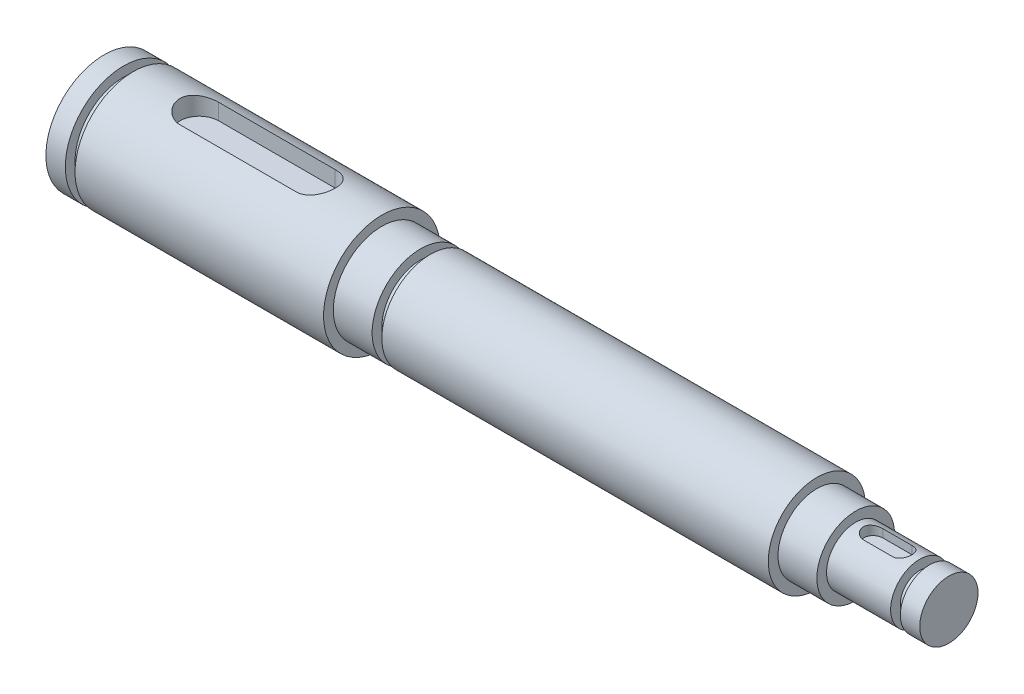
ISO-10303-21;
HEADER;
FILE_DESCRIPTION(('STEP AP214'),'2;1');
FILE_NAME('part.step','',(''),(''),'','','');
FILE_SCHEMA(('AUTOMOTIVE_DESIGN { 1 0 10303 214 1 1 1 1 }'));
ENDSEC;
DATA;
#1=APPLICATION_CONTEXT('core data for automotive mechanical design processes');
#2=APPLICATION_PROTOCOL_DEFINITION('international standard','automotive_design',2000,#1);
#3=PRODUCT_CONTEXT('',#1,'mechanical');
#4=PRODUCT('Part','Part','',(#3));
#5=PRODUCT_RELATED_PRODUCT_CATEGORY('part','',(#4));
#6=PRODUCT_DEFINITION_FORMATION('','',#4);
#7=PRODUCT_DEFINITION_CONTEXT('part definition',#1,'design');
#8=PRODUCT_DEFINITION('design','',#6,#7);
#9=PRODUCT_DEFINITION_SHAPE('','',#8);
#10=(LENGTH_UNIT() NAMED_UNIT(*) SI_UNIT(.MILLI.,.METRE.));
#11=(NAMED_UNIT(*) PLANE_ANGLE_UNIT() SI_UNIT($,.RADIAN.));
#12=(NAMED_UNIT(*) SI_UNIT($,.STERADIAN.) SOLID_ANGLE_UNIT());
#13=UNCERTAINTY_MEASURE_WITH_UNIT(LENGTH_MEASURE(1.E-05),#10,'distance_accuracy_value','');
#14=(GEOMETRIC_REPRESENTATION_CONTEXT(3) GLOBAL_UNCERTAINTY_ASSIGNED_CONTEXT((#13)) GLOBAL_UNIT_ASSIGNED_CONTEXT((#10,
#11,#12)) REPRESENTATION_CONTEXT('',''));
#15=CARTESIAN_POINT('',(0.,0.,0.));
#16=DIRECTION('',(0.,0.,1.));
#17=DIRECTION('',(1.,0.,0.));
#18=AXIS2_PLACEMENT_3D('',#15,#16,#17);
#19=CARTESIAN_POINT('',(0.,0.,0.));
#20=DIRECTION('',(-1.,0.,0.));
#21=DIRECTION('',(0.,0.,1.));
#22=AXIS2_PLACEMENT_3D('',#19,#20,#21);
#23=PLANE('',#22);
#24=CARTESIAN_POINT('',(0.,0.,0.));
#25=DIRECTION('',(1.,0.,0.));
#26=DIRECTION('',(0.,0.,-1.));
#27=AXIS2_PLACEMENT_3D('',#24,#25,#26);
#28=CIRCLE('',#27,9.525);
#29=CARTESIAN_POINT('',(0.,0.,-9.525));
#30=VERTEX_POINT('',#29);
#31=EDGE_CURVE('E209',#30,#30,#28,.T.);
#32=ORIENTED_EDGE('',*,*,#31,.F.);
#33=EDGE_LOOP('',(#32));
#34=FACE_BOUND('',#33,.T.);
#35=ADVANCED_FACE('F36',(#34),#23,.T.);
#36=CARTESIAN_POINT('',(0.,0.,0.));
#37=DIRECTION('',(1.,0.,0.));
#38=DIRECTION('',(0.,0.,-1.));
#39=AXIS2_PLACEMENT_3D('',#36,#37,#38);
#40=CYLINDRICAL_SURFACE('',#39,9.525);
#41=ORIENTED_EDGE('',*,*,#31,.T.);
#42=EDGE_LOOP('',(#41));
#43=FACE_BOUND('',#42,.T.);
#44=CARTESIAN_POINT('',(3.175,0.,0.));
#45=DIRECTION('',(1.,0.,0.));
#46=DIRECTION('',(0.,0.,-1.));
#47=AXIS2_PLACEMENT_3D('',#44,#45,#46);
#48=CIRCLE('',#47,9.525);
#49=CARTESIAN_POINT('',(3.175,0.,-9.525));
#50=VERTEX_POINT('',#49);
#51=EDGE_CURVE('E206',#50,#50,#48,.T.);
#52=ORIENTED_EDGE('',*,*,#51,.F.);
#53=EDGE_LOOP('',(#52));
#54=FACE_BOUND('',#53,.T.);
#55=ADVANCED_FACE('F319',(#43,#54),#40,.T.);
#56=CARTESIAN_POINT('',(3.175,9.525,0.));
#57=DIRECTION('',(1.,0.,0.));
#58=DIRECTION('',(0.,0.,-1.));
#59=AXIS2_PLACEMENT_3D('',#56,#57,#58);
#60=PLANE('',#59);
#61=ORIENTED_EDGE('',*,*,#51,.T.);
#62=EDGE_LOOP('',(#61));
#63=FACE_BOUND('',#62,.T.);
#64=CARTESIAN_POINT('',(3.175,0.,0.));
#65=DIRECTION('',(1.,0.,0.));
#66=DIRECTION('',(0.,0.,-1.));
#67=AXIS2_PLACEMENT_3D('',#64,#65,#66);
#68=CIRCLE('',#67,7.9375);
#69=CARTESIAN_POINT('',(3.175,0.,-7.9375));
#70=VERTEX_POINT('',#69);
#71=EDGE_CURVE('E203',#70,#70,#68,.T.);
#72=ORIENTED_EDGE('',*,*,#71,.F.);
#73=EDGE_LOOP('',(#72));
#74=FACE_BOUND('',#73,.T.);
#75=ADVANCED_FACE('F324',(#63,#74),#60,.T.);
#76=CARTESIAN_POINT('',(0.,0.,0.));
#77=DIRECTION('',(1.,0.,0.));
#78=DIRECTION('',(0.,0.,-1.));
#79=AXIS2_PLACEMENT_3D('',#76,#77,#78);
#80=CYLINDRICAL_SURFACE('',#79,7.9375);
#81=ORIENTED_EDGE('',*,*,#71,.T.);
#82=EDGE_LOOP('',(#81));
#83=FACE_BOUND('',#82,.T.);
#84=CARTESIAN_POINT('',(4.7625,0.,0.));
#85=DIRECTION('',(1.,0.,0.));
#86=DIRECTION('',(0.,0.,-1.));
#87=AXIS2_PLACEMENT_3D('',#84,#85,#86);
#88=CIRCLE('',#87,7.9375);
#89=CARTESIAN_POINT('',(4.7625,0.,-7.9375));
#90=VERTEX_POINT('',#89);
#91=EDGE_CURVE('E200',#90,#90,#88,.T.);
#92=ORIENTED_EDGE('',*,*,#91,.F.);
#93=EDGE_LOOP('',(#92));
#94=FACE_BOUND('',#93,.T.);
#95=ADVANCED_FACE('F332',(#83,#94),#80,.T.);
#96=CARTESIAN_POINT('',(4.7625,7.9375,0.));
#97=DIRECTION('',(-1.,0.,0.));
#98=DIRECTION('',(0.,0.,1.));
#99=AXIS2_PLACEMENT_3D('',#96,#97,#98);
#100=PLANE('',#99);
#101=ORIENTED_EDGE('',*,*,#91,.T.);
#102=EDGE_LOOP('',(#101));
#103=FACE_BOUND('',#102,.T.);
#104=CARTESIAN_POINT('',(4.7625,0.,0.));
#105=DIRECTION('',(1.,0.,0.));
#106=DIRECTION('',(0.,0.,-1.));
#107=AXIS2_PLACEMENT_3D('',#104,#105,#106);
#108=CIRCLE('',#107,9.525);
#109=CARTESIAN_POINT('',(4.7625,0.,-9.525));
#110=VERTEX_POINT('',#109);
#111=EDGE_CURVE('E197',#110,#110,#108,.T.);
#112=ORIENTED_EDGE('',*,*,#111,.F.);
#113=EDGE_LOOP('',(#112));
#114=FACE_BOUND('',#113,.T.);
#115=ADVANCED_FACE('F338',(#103,#114),#100,.T.);
#116=CARTESIAN_POINT('',(0.,0.,0.));
#117=DIRECTION('',(1.,0.,0.));
#118=DIRECTION('',(0.,0.,-1.));
#119=AXIS2_PLACEMENT_3D('',#116,#117,#118);
#120=CYLINDRICAL_SURFACE('',#119,9.525);
#121=CARTESIAN_POINT('',(34.6075,8.98025612106915,3.175));
#122=CARTESIAN_POINT('',(34.6941229888318,8.9802423045691,3.17501141870215));
#123=CARTESIAN_POINT('',(34.7807382548377,8.98150913758803,3.17145526771413));
#124=CARTESIAN_POINT('',(34.9532969187036,8.9865012563368,3.15729678141198));
#125=CARTESIAN_POINT('',(35.0392404915948,8.99022587842316,3.14669634816447));
#126=CARTESIAN_POINT('',(35.2095949202103,9.00001635670684,3.1185797346695));
#127=CARTESIAN_POINT('',(35.2940095522396,9.0060752675965,3.10108406659181));
#128=CARTESIAN_POINT('',(35.4609505011002,9.02033527280623,3.05935609908253));
#129=CARTESIAN_POINT('',(35.5434767495693,9.0285364445462,3.03512355618263));
#130=CARTESIAN_POINT('',(35.7872812062373,9.05598824808267,2.95264270158864));
#131=CARTESIAN_POINT('',(35.9450375299855,9.07810279732742,2.88456899348992));
#132=CARTESIAN_POINT('',(36.2469135505599,9.12745233291153,2.72437585814969));
#133=CARTESIAN_POINT('',(36.3910247994461,9.15469046059877,2.63224166551133));
#134=CARTESIAN_POINT('',(36.6671769874024,9.21240451634628,2.42269004725358));
#135=CARTESIAN_POINT('',(36.7986121312949,9.24296080573605,2.30449481480772));
#136=CARTESIAN_POINT('',(37.0402067211275,9.30318975942108,2.04783780412336));
#137=CARTESIAN_POINT('',(37.1503623785527,9.33286226557717,1.90937242476788));
#138=CARTESIAN_POINT('',(37.3490467447338,9.38891576742204,1.61164171565864));
#139=CARTESIAN_POINT('',(37.4369359305322,9.41519063786191,1.45192782105673));
#140=CARTESIAN_POINT('',(37.5843555939925,9.46053507792341,1.11896283130951));
#141=CARTESIAN_POINT('',(37.6438947346775,9.47960684825285,0.945715890365636));
#142=CARTESIAN_POINT('',(37.7308608797652,9.50782550756653,0.596993181200781));
#143=CARTESIAN_POINT('',(37.7593328731396,9.5172945599896,0.421804576215316));
#144=CARTESIAN_POINT('',(37.7866792650331,9.52638456721869,0.0688942262177281));
#145=CARTESIAN_POINT('',(37.7855607159795,9.52600786860052,-0.108826905115811));
#146=CARTESIAN_POINT('',(37.7544193835561,9.51566672631501,-0.454354710768469));
#147=CARTESIAN_POINT('',(37.7255320714269,9.50607893544864,-0.622276840369554));
#148=CARTESIAN_POINT('',(37.6415516472644,9.47886599692519,-0.950734894861877));
#149=CARTESIAN_POINT('',(37.5864570821377,9.46124040360451,-1.11127040965181));
#150=CARTESIAN_POINT('',(37.4509619543152,9.41945246382315,-1.422884614729));
#151=CARTESIAN_POINT('',(37.3702380671974,9.39520718715483,-1.5738111430507));
#152=CARTESIAN_POINT('',(37.186045394075,9.34270382305686,-1.86031043274779));
#153=CARTESIAN_POINT('',(37.082570420982,9.31444464480037,-1.99587900234785));
#154=CARTESIAN_POINT('',(36.8500915243982,9.25532407861077,-2.25455959173543));
#155=CARTESIAN_POINT('',(36.7201163706817,9.22440281116213,-2.37678676918464));
#156=CARTESIAN_POINT('',(36.4412593020655,9.16455803450652,-2.59801162582849));
#157=CARTESIAN_POINT('',(36.2923713029155,9.13563517282882,-2.69700180037897));
#158=CARTESIAN_POINT('',(35.9768985838664,9.08272269199518,-2.87021834678402));
#159=CARTESIAN_POINT('',(35.8100850650662,9.05881220234969,-2.94405757319701));
#160=CARTESIAN_POINT('',(35.5518676242628,9.02936653323678,-3.0326733025657));
#161=CARTESIAN_POINT('',(35.464478265434,9.02062228933348,-3.05851877555986));
#162=CARTESIAN_POINT('',(35.2876163306774,9.00554368630543,-3.10263697775581));
#163=CARTESIAN_POINT('',(35.1981447257693,8.99920822686967,-3.12091316488063));
#164=CARTESIAN_POINT('',(35.0252947810473,8.98959087559101,-3.14850521757429));
#165=CARTESIAN_POINT('',(34.9420255558268,8.9860995295135,-3.15843785822583));
#166=CARTESIAN_POINT('',(34.7750071479407,8.98142776184118,-3.17168561119408));
#167=CARTESIAN_POINT('',(34.6912587249957,8.98024435831545,-3.17500926263186));
#168=CARTESIAN_POINT('',(34.6075,8.98025612106916,-3.175));
#169=B_SPLINE_CURVE_WITH_KNOTS('',3,(#121,#122,#123,#124,#125,#126,#127,#128,#129,#130,#131,
#132,#133,#134,#135,#136,#137,#138,#139,#140,#141,#142,#143,#144,#145,#146,#147,#148,#149,#150,
#151,#152,#153,#154,#155,#156,#157,#158,#159,#160,#161,#162,#163,#164,#165,#166,#167,#168),
.UNSPECIFIED.,.F.,.F.,(4,2,2,2,2,2,2,2,2,2,2,2,2,2,2,2,2,2,2,2,2,2,2,4),(0.,0.259773689035001,
0.519477263588045,0.778414025374931,1.03736014626284,1.55449291492533,2.07194378556213,
2.60766387392255,3.14347925203152,3.69327981198351,4.24291225945333,4.77342553695258,
5.30381237633043,5.81339512764462,6.3230061366944,6.83932018908201,7.35577482555093,
7.89650105770063,8.43740168377098,8.9862872915728,9.26063415404914,9.53485554636031,
9.78636405546802,10.0375473922007),.UNSPECIFIED.);
#170=CARTESIAN_POINT('',(34.6075,8.98025612106915,3.175));
#171=VERTEX_POINT('',#170);
#172=CARTESIAN_POINT('',(34.6075,8.98025612106915,-3.175));
#173=VERTEX_POINT('',#172);
#174=EDGE_CURVE('E212',#171,#173,#169,.T.);
#175=ORIENTED_EDGE('',*,*,#174,.F.);
#176=DIRECTION('',(1.,0.,0.));
#177=VECTOR('',#176,1.);
#178=CARTESIAN_POINT('',(0.,8.98025612106915,3.175));
#179=LINE('',#178,#177);
#180=CARTESIAN_POINT('',(15.5575,8.98025612106915,3.175));
#181=VERTEX_POINT('',#180);
#182=EDGE_CURVE('E251',#181,#171,#179,.T.);
#183=ORIENTED_EDGE('',*,*,#182,.F.);
#184=CARTESIAN_POINT('',(15.5575,8.98025612106915,-3.175));
#185=CARTESIAN_POINT('',(15.4708770111682,8.9802423045691,-3.17501141870215));
#186=CARTESIAN_POINT('',(15.3842617451623,8.98150913758803,-3.17145526771413));
#187=CARTESIAN_POINT('',(15.2117030812964,8.9865012563368,-3.15729678141198));
#188=CARTESIAN_POINT('',(15.1257595084052,8.99022587842316,-3.14669634816447));
#189=CARTESIAN_POINT('',(14.9554050797897,9.00001635670684,-3.1185797346695));
#190=CARTESIAN_POINT('',(14.8709904477604,9.0060752675965,-3.10108406659181));
#191=CARTESIAN_POINT('',(14.7040494988998,9.02033527280623,-3.05935609908253));
#192=CARTESIAN_POINT('',(14.6215232504307,9.0285364445462,-3.03512355618263));
#193=CARTESIAN_POINT('',(14.3777187937627,9.05598824808267,-2.95264270158864));
#194=CARTESIAN_POINT('',(14.2199624700145,9.07810279732742,-2.88456899348992));
#195=CARTESIAN_POINT('',(13.9180864494401,9.12745233291153,-2.72437585814969));
#196=CARTESIAN_POINT('',(13.7739752005539,9.15469046059877,-2.63224166551133));
#197=CARTESIAN_POINT('',(13.4978230125975,9.21240451634628,-2.42269004725358));
#198=CARTESIAN_POINT('',(13.3663878687051,9.24296080573605,-2.30449481480772));
#199=CARTESIAN_POINT('',(13.1247932788725,9.30318975942108,-2.04783780412336));
#200=CARTESIAN_POINT('',(13.0146376214474,9.33286226557717,-1.90937242476788));
#201=CARTESIAN_POINT('',(12.8159532552662,9.38891576742204,-1.61164171565864));
#202=CARTESIAN_POINT('',(12.7280640694678,9.41519063786191,-1.45192782105673));
#203=CARTESIAN_POINT('',(12.5806444060075,9.46053507792341,-1.11896283130951));
#204=CARTESIAN_POINT('',(12.5211052653225,9.47960684825285,-0.94571589036564));
#205=CARTESIAN_POINT('',(12.4341391202348,9.50782550756653,-0.596993181200784));
#206=CARTESIAN_POINT('',(12.4056671268604,9.5172945599896,-0.421804576215318));
#207=CARTESIAN_POINT('',(12.3783207349669,9.52638456721869,-0.0688942262177296));
#208=CARTESIAN_POINT('',(12.3794392840205,9.52600786860052,0.10882690511581));
#209=CARTESIAN_POINT('',(12.4105806164439,9.51566672631501,0.454354710768468));
#210=CARTESIAN_POINT('',(12.4394679285731,9.50607893544864,0.622276840369554));
#211=CARTESIAN_POINT('',(12.5234483527356,9.47886599692519,0.950734894861878));
#212=CARTESIAN_POINT('',(12.5785429178623,9.46124040360451,1.11127040965182));
#213=CARTESIAN_POINT('',(12.7140380456848,9.41945246382315,1.422884614729));
#214=CARTESIAN_POINT('',(12.7947619328026,9.39520718715483,1.5738111430507));
#215=CARTESIAN_POINT('',(12.978954605925,9.34270382305686,1.86031043274779));
#216=CARTESIAN_POINT('',(13.082429579018,9.31444464480037,1.99587900234785));
#217=CARTESIAN_POINT('',(13.3149084756018,9.25532407861076,2.25455959173543));
#218=CARTESIAN_POINT('',(13.4448836293183,9.22440281116213,2.37678676918464));
#219=CARTESIAN_POINT('',(13.7237406979345,9.16455803450652,2.59801162582849));
#220=CARTESIAN_POINT('',(13.8726286970845,9.13563517282882,2.69700180037897));
#221=CARTESIAN_POINT('',(14.1881014161336,9.08272269199518,2.87021834678402));
#222=CARTESIAN_POINT('',(14.3549149349338,9.05881220234969,2.94405757319701));
#223=CARTESIAN_POINT('',(14.6131323757371,9.02936653323678,3.03267330256571));
#224=CARTESIAN_POINT('',(14.700521734566,9.02062228933348,3.05851877555986));
#225=CARTESIAN_POINT('',(14.8773836693226,9.00554368630543,3.10263697775581));
#226=CARTESIAN_POINT('',(14.9668552742307,8.99920822686967,3.12091316488063));
#227=CARTESIAN_POINT('',(15.1397052189527,8.98959087559101,3.14850521757429));
#228=CARTESIAN_POINT('',(15.2229744441732,8.9860995295135,3.15843785822583));
#229=CARTESIAN_POINT('',(15.3899928520593,8.98142776184118,3.17168561119408));
#230=CARTESIAN_POINT('',(15.4737412750042,8.98024435831545,3.17500926263186));
#231=CARTESIAN_POINT('',(15.5575,8.98025612106916,3.175));
#232=B_SPLINE_CURVE_WITH_KNOTS('',3,(#184,#185,#186,#187,#188,#189,#190,#191,#192,#193,#194,
#195,#196,#197,#198,#199,#200,#201,#202,#203,#204,#205,#206,#207,#208,#209,#210,#211,#212,#213,
#214,#215,#216,#217,#218,#219,#220,#221,#222,#223,#224,#225,#226,#227,#228,#229,#230,#231),
.UNSPECIFIED.,.F.,.F.,(4,2,2,2,2,2,2,2,2,2,2,2,2,2,2,2,2,2,2,2,2,2,2,4),(0.,0.259773689035001,
0.519477263588043,0.778414025374926,1.03736014626284,1.55449291492533,2.07194378556214,
2.60766387392255,3.14347925203151,3.6932798119835,4.24291225945333,4.77342553695257,
5.30381237633043,5.81339512764462,6.3230061366944,6.83932018908201,7.35577482555094,
7.89650105770063,8.43740168377098,8.9862872915728,9.26063415404914,9.53485554636031,
9.78636405546803,10.0375473922007),.UNSPECIFIED.);
#233=CARTESIAN_POINT('',(15.5575,8.98025612106915,-3.175));
#234=VERTEX_POINT('',#233);
#235=EDGE_CURVE('E245',#234,#181,#232,.T.);
#236=ORIENTED_EDGE('',*,*,#235,.F.);
#237=DIRECTION('',(1.,0.,0.));
#238=VECTOR('',#237,1.);
#239=CARTESIAN_POINT('',(0.,8.98025612106915,-3.175));
#240=LINE('',#239,#238);
#241=EDGE_CURVE('E220',#173,#234,#240,.F.);
#242=ORIENTED_EDGE('',*,*,#241,.F.);
#243=EDGE_LOOP('',(#175,#183,#236,#242));
#244=FACE_BOUND('',#243,.T.);
#245=ORIENTED_EDGE('',*,*,#111,.T.);
#246=EDGE_LOOP('',(#245));
#247=FACE_BOUND('',#246,.T.);
#248=CARTESIAN_POINT('',(45.4025,0.,0.));
#249=DIRECTION('',(1.,0.,0.));
#250=DIRECTION('',(0.,0.,-1.));
#251=AXIS2_PLACEMENT_3D('',#248,#249,#250);
#252=CIRCLE('',#251,9.525);
#253=CARTESIAN_POINT('',(45.4025,0.,-9.525));
#254=VERTEX_POINT('',#253);
#255=EDGE_CURVE('E194',#254,#254,#252,.T.);
#256=ORIENTED_EDGE('',*,*,#255,.F.);
#257=EDGE_LOOP('',(#256));
#258=FACE_BOUND('',#257,.T.);
#259=ADVANCED_FACE('F222',(#244,#247,#258),#120,.T.);
#260=CARTESIAN_POINT('',(45.4025,9.525,0.));
#261=DIRECTION('',(1.,0.,0.));
#262=DIRECTION('',(0.,0.,-1.));
#263=AXIS2_PLACEMENT_3D('',#260,#261,#262);
#264=PLANE('',#263);
#265=ORIENTED_EDGE('',*,*,#255,.T.);
#266=EDGE_LOOP('',(#265));
#267=FACE_BOUND('',#266,.T.);
#268=CARTESIAN_POINT('',(45.4025,0.,0.));
#269=DIRECTION('',(1.,0.,0.));
#270=DIRECTION('',(0.,0.,-1.));
#271=AXIS2_PLACEMENT_3D('',#268,#269,#270);
#272=CIRCLE('',#271,7.93750000000001);
#273=CARTESIAN_POINT('',(45.4025,0.,-7.93750000000001));
#274=VERTEX_POINT('',#273);
#275=EDGE_CURVE('E191',#274,#274,#272,.T.);
#276=ORIENTED_EDGE('',*,*,#275,.F.);
#277=EDGE_LOOP('',(#276));
#278=FACE_BOUND('',#277,.T.);
#279=ADVANCED_FACE('F348',(#267,#278),#264,.T.);
#280=CARTESIAN_POINT('',(0.,0.,0.));
#281=DIRECTION('',(1.,0.,0.));
#282=DIRECTION('',(0.,0.,-1.));
#283=AXIS2_PLACEMENT_3D('',#280,#281,#282);
#284=CYLINDRICAL_SURFACE('',#283,7.93750000000001);
#285=ORIENTED_EDGE('',*,*,#275,.T.);
#286=EDGE_LOOP('',(#285));
#287=FACE_BOUND('',#286,.T.);
#288=CARTESIAN_POINT('',(51.7525,0.,0.));
#289=DIRECTION('',(1.,0.,0.));
#290=DIRECTION('',(0.,0.,-1.));
#291=AXIS2_PLACEMENT_3D('',#288,#289,#290);
#292=CIRCLE('',#291,7.93750000000001);
#293=CARTESIAN_POINT('',(51.7525,0.,-7.93750000000001));
#294=VERTEX_POINT('',#293);
#295=EDGE_CURVE('E188',#294,#294,#292,.T.);
#296=ORIENTED_EDGE('',*,*,#295,.F.);
#297=EDGE_LOOP('',(#296));
#298=FACE_BOUND('',#297,.T.);
#299=ADVANCED_FACE('F354',(#287,#298),#284,.T.);
#300=CARTESIAN_POINT('',(51.7525,7.93750000000001,0.));
#301=DIRECTION('',(1.,0.,0.));
#302=DIRECTION('',(0.,0.,-1.));
#303=AXIS2_PLACEMENT_3D('',#300,#301,#302);
#304=PLANE('',#303);
#305=ORIENTED_EDGE('',*,*,#295,.T.);
#306=EDGE_LOOP('',(#305));
#307=FACE_BOUND('',#306,.T.);
#308=CARTESIAN_POINT('',(51.7525,0.,0.));
#309=DIRECTION('',(1.,0.,0.));
#310=DIRECTION('',(0.,0.,-1.));
#311=AXIS2_PLACEMENT_3D('',#308,#309,#310);
#312=CIRCLE('',#311,6.35000000000001);
#313=CARTESIAN_POINT('',(51.7525,0.,-6.35000000000001));
#314=VERTEX_POINT('',#313);
#315=EDGE_CURVE('E185',#314,#314,#312,.T.);
#316=ORIENTED_EDGE('',*,*,#315,.F.);
#317=EDGE_LOOP('',(#316));
#318=FACE_BOUND('',#317,.T.);
#319=ADVANCED_FACE('F359',(#307,#318),#304,.T.);
#320=CARTESIAN_POINT('',(0.,0.,0.));
#321=DIRECTION('',(1.,0.,0.));
#322=DIRECTION('',(0.,0.,-1.));
#323=AXIS2_PLACEMENT_3D('',#320,#321,#322);
#324=CYLINDRICAL_SURFACE('',#323,6.35000000000001);
#325=ORIENTED_EDGE('',*,*,#315,.T.);
#326=EDGE_LOOP('',(#325));
#327=FACE_BOUND('',#326,.T.);
#328=CARTESIAN_POINT('',(53.34,0.,0.));
#329=DIRECTION('',(1.,0.,0.));
#330=DIRECTION('',(0.,0.,-1.));
#331=AXIS2_PLACEMENT_3D('',#328,#329,#330);
#332=CIRCLE('',#331,6.35000000000001);
#333=CARTESIAN_POINT('',(53.34,0.,-6.35000000000001));
#334=VERTEX_POINT('',#333);
#335=EDGE_CURVE('E182',#334,#334,#332,.T.);
#336=ORIENTED_EDGE('',*,*,#335,.F.);
#337=EDGE_LOOP('',(#336));
#338=FACE_BOUND('',#337,.T.);
#339=ADVANCED_FACE('F365',(#327,#338),#324,.T.);
#340=CARTESIAN_POINT('',(53.34,6.35000000000001,0.));
#341=DIRECTION('',(-1.,0.,0.));
#342=DIRECTION('',(0.,0.,1.));
#343=AXIS2_PLACEMENT_3D('',#340,#341,#342);
#344=PLANE('',#343);
#345=ORIENTED_EDGE('',*,*,#335,.T.);
#346=EDGE_LOOP('',(#345));
#347=FACE_BOUND('',#346,.T.);
#348=CARTESIAN_POINT('',(53.34,0.,0.));
#349=DIRECTION('',(1.,0.,0.));
#350=DIRECTION('',(0.,0.,-1.));
#351=AXIS2_PLACEMENT_3D('',#348,#349,#350);
#352=CIRCLE('',#351,7.93750000000001);
#353=CARTESIAN_POINT('',(53.34,0.,-7.93750000000001));
#354=VERTEX_POINT('',#353);
#355=EDGE_CURVE('E179',#354,#354,#352,.T.);
#356=ORIENTED_EDGE('',*,*,#355,.F.);
#357=EDGE_LOOP('',(#356));
#358=FACE_BOUND('',#357,.T.);
#359=ADVANCED_FACE('F371',(#347,#358),#344,.T.);
#360=CARTESIAN_POINT('',(0.,0.,0.));
#361=DIRECTION('',(1.,0.,0.));
#362=DIRECTION('',(0.,0.,-1.));
#363=AXIS2_PLACEMENT_3D('',#360,#361,#362);
#364=CYLINDRICAL_SURFACE('',#363,7.93750000000001);
#365=ORIENTED_EDGE('',*,*,#355,.T.);
#366=EDGE_LOOP('',(#365));
#367=FACE_BOUND('',#366,.T.);
#368=CARTESIAN_POINT('',(116.5225,0.,0.));
#369=DIRECTION('',(1.,0.,0.));
#370=DIRECTION('',(0.,0.,-1.));
#371=AXIS2_PLACEMENT_3D('',#368,#369,#370);
#372=CIRCLE('',#371,7.93750000000001);
#373=CARTESIAN_POINT('',(116.5225,0.,-7.93750000000001));
#374=VERTEX_POINT('',#373);
#375=EDGE_CURVE('E176',#374,#374,#372,.T.);
#376=ORIENTED_EDGE('',*,*,#375,.F.);
#377=EDGE_LOOP('',(#376));
#378=FACE_BOUND('',#377,.T.);
#379=ADVANCED_FACE('F377',(#367,#378),#364,.T.);
#380=CARTESIAN_POINT('',(116.5225,7.93750000000001,0.));
#381=DIRECTION('',(1.,0.,0.));
#382=DIRECTION('',(0.,0.,-1.));
#383=AXIS2_PLACEMENT_3D('',#380,#381,#382);
#384=PLANE('',#383);
#385=ORIENTED_EDGE('',*,*,#375,.T.);
#386=EDGE_LOOP('',(#385));
#387=FACE_BOUND('',#386,.T.);
#388=CARTESIAN_POINT('',(116.5225,0.,0.));
#389=DIRECTION('',(1.,0.,0.));
#390=DIRECTION('',(0.,0.,-1.));
#391=AXIS2_PLACEMENT_3D('',#388,#389,#390);
#392=CIRCLE('',#391,6.35000000000001);
#393=CARTESIAN_POINT('',(116.5225,0.,-6.35000000000001));
#394=VERTEX_POINT('',#393);
#395=EDGE_CURVE('E173',#394,#394,#392,.T.);
#396=ORIENTED_EDGE('',*,*,#395,.F.);
#397=EDGE_LOOP('',(#396));
#398=FACE_BOUND('',#397,.T.);
#399=ADVANCED_FACE('F383',(#387,#398),#384,.T.);
#400=CARTESIAN_POINT('',(0.,0.,0.));
#401=DIRECTION('',(1.,0.,0.));
#402=DIRECTION('',(0.,0.,-1.));
#403=AXIS2_PLACEMENT_3D('',#400,#401,#402);
#404=CYLINDRICAL_SURFACE('',#403,6.35000000000001);
#405=ORIENTED_EDGE('',*,*,#395,.T.);
#406=EDGE_LOOP('',(#405));
#407=FACE_BOUND('',#406,.T.);
#408=CARTESIAN_POINT('',(122.8725,0.,0.));
#409=DIRECTION('',(1.,0.,0.));
#410=DIRECTION('',(0.,0.,-1.));
#411=AXIS2_PLACEMENT_3D('',#408,#409,#410);
#412=CIRCLE('',#411,6.35000000000001);
#413=CARTESIAN_POINT('',(122.8725,0.,-6.35000000000001));
#414=VERTEX_POINT('',#413);
#415=EDGE_CURVE('E170',#414,#414,#412,.T.);
#416=ORIENTED_EDGE('',*,*,#415,.F.);
#417=EDGE_LOOP('',(#416));
#418=FACE_BOUND('',#417,.T.);
#419=ADVANCED_FACE('F389',(#407,#418),#404,.T.);
#420=CARTESIAN_POINT('',(122.8725,6.35000000000001,0.));
#421=DIRECTION('',(1.,0.,0.));
#422=DIRECTION('',(0.,0.,-1.));
#423=AXIS2_PLACEMENT_3D('',#420,#421,#422);
#424=PLANE('',#423);
#425=ORIENTED_EDGE('',*,*,#415,.T.);
#426=EDGE_LOOP('',(#425));
#427=FACE_BOUND('',#426,.T.);
#428=CARTESIAN_POINT('',(122.8725,0.,0.));
#429=DIRECTION('',(1.,0.,0.));
#430=DIRECTION('',(0.,0.,-1.));
#431=AXIS2_PLACEMENT_3D('',#428,#429,#430);
#432=CIRCLE('',#431,4.76250000000002);
#433=CARTESIAN_POINT('',(122.8725,0.,-4.76250000000002));
#434=VERTEX_POINT('',#433);
#435=EDGE_CURVE('E167',#434,#434,#432,.T.);
#436=ORIENTED_EDGE('',*,*,#435,.F.);
#437=EDGE_LOOP('',(#436));
#438=FACE_BOUND('',#437,.T.);
#439=ADVANCED_FACE('F289',(#427,#438),#424,.T.);
#440=CARTESIAN_POINT('',(0.,0.,0.));
#441=DIRECTION('',(1.,0.,0.));
#442=DIRECTION('',(0.,0.,-1.));
#443=AXIS2_PLACEMENT_3D('',#440,#441,#442);
#444=CYLINDRICAL_SURFACE('',#443,4.76250000000002);
#445=CARTESIAN_POINT('',(130.4925,4.49012806053459,1.5875));
#446=CARTESIAN_POINT('',(130.535823663672,4.49012376824764,1.58750118659148));
#447=CARTESIAN_POINT('',(130.579125211226,4.49075587659903,1.58572537278249));
#448=CARTESIAN_POINT('',(130.665392377187,4.4932493207164,1.57865065117029));
#449=CARTESIAN_POINT('',(130.70835808311,4.49511032466045,1.57335269440072));
#450=CARTESIAN_POINT('',(130.836022527322,4.50245308906635,1.55227444692888));
#451=CARTESIAN_POINT('',(130.919824593454,4.50969526842982,1.53130921993213));
#452=CARTESIAN_POINT('',(131.082454993004,4.5279956858444,1.4763089787808));
#453=CARTESIAN_POINT('',(131.161286043161,4.53905181775277,1.44228117688021));
#454=CARTESIAN_POINT('',(131.312189486484,4.56372574710895,1.36219125098173));
#455=CARTESIAN_POINT('',(131.384257692394,4.57734511612123,1.31612173723109));
#456=CARTESIAN_POINT('',(131.522343367228,4.60620237638252,1.21134408721778));
#457=CARTESIAN_POINT('',(131.588057372734,4.62148043457192,1.15224715626124));
#458=CARTESIAN_POINT('',(131.708852053244,4.65159484800104,1.02391915324899));
#459=CARTESIAN_POINT('',(131.763930834794,4.66643112419068,0.954686280480328));
#460=CARTESIAN_POINT('',(131.863273736102,4.69445789253337,0.805820787955566));
#461=CARTESIAN_POINT('',(131.907218062739,4.70759532129445,0.725963891856615));
#462=CARTESIAN_POINT('',(131.980927699554,4.73026753659897,0.559481434320802));
#463=CARTESIAN_POINT('',(132.01069734114,4.7398034234938,0.472857950004548));
#464=CARTESIAN_POINT('',(132.05418046517,4.75391275439391,0.298496585946374));
#465=CARTESIAN_POINT('',(132.068416445179,4.75864728019362,0.210902287205421));
#466=CARTESIAN_POINT('',(132.082089623909,4.76319228341061,0.0344471140108763));
#467=CARTESIAN_POINT('',(132.081530348841,4.76300393411569,-0.0544134536020655));
#468=CARTESIAN_POINT('',(132.065959700568,4.75783336333486,-0.227177354381039));
#469=CARTESIAN_POINT('',(132.051516062239,4.75303946823633,-0.311138415418041));
#470=CARTESIAN_POINT('',(132.009525797105,4.73943299795059,-0.475367452197943));
#471=CARTESIAN_POINT('',(131.981978443748,4.7306201999315,-0.555635222891139));
#472=CARTESIAN_POINT('',(131.914231075759,4.70972623380697,-0.711442289061659));
#473=CARTESIAN_POINT('',(131.873869403368,4.69760360068322,-0.78690550272572));
#474=CARTESIAN_POINT('',(131.781772327167,4.67135190442071,-0.930155285192268));
#475=CARTESIAN_POINT('',(131.730033829464,4.65722229586181,-0.997939758172062));
#476=CARTESIAN_POINT('',(131.61379720813,4.62766206709101,-1.12727952679154));
#477=CARTESIAN_POINT('',(131.54881369952,4.61220151154365,-1.18839235843516));
#478=CARTESIAN_POINT('',(131.409374135076,4.58227891125653,-1.29900683940236));
#479=CARTESIAN_POINT('',(131.334915030935,4.5678171901626,-1.3485047375543));
#480=CARTESIAN_POINT('',(131.177220216864,4.54136174809906,-1.43510527937854));
#481=CARTESIAN_POINT('',(131.093871170044,4.52940761230324,-1.47201415259344));
#482=CARTESIAN_POINT('',(130.921685423076,4.50978741585989,-1.53108061623801));
#483=CARTESIAN_POINT('',(130.832857629272,4.50211458936778,-1.55326149223787));
#484=CARTESIAN_POINT('',(130.701385414163,4.49479260575369,-1.57425732309581));
#485=CARTESIAN_POINT('',(130.659756793606,4.49304834965182,-1.5792212847425));
#486=CARTESIAN_POINT('',(130.57625955054,4.49071529419597,-1.58584045301303));
#487=CARTESIAN_POINT('',(130.534391307911,4.49012500388127,-1.58749992918953));
#488=CARTESIAN_POINT('',(130.4925,4.49012806053459,-1.5875));
#489=B_SPLINE_CURVE_WITH_KNOTS('',3,(#445,#446,#447,#448,#449,#450,#451,#452,#453,#454,#455,
#456,#457,#458,#459,#460,#461,#462,#463,#464,#465,#466,#467,#468,#469,#470,#471,#472,#473,#474,
#475,#476,#477,#478,#479,#480,#481,#482,#483,#484,#485,#486,#487,#488),.UNSPECIFIED.,.F.,.F.,(4,
2,2,2,2,2,2,2,2,2,2,2,2,2,2,2,2,2,2,2,2,4),(0.,0.12988684451748,0.259738631794008,
0.518447652452661,0.777014036783898,1.0357394721023,1.30359951628249,1.57150720533698,
1.84640748531298,2.1212237090479,2.38648034779752,2.65167376748645,2.90646514314355,
3.16127064766844,3.41942767386225,3.6776549920967,3.94801810817152,4.2184684212067,
4.49291122510761,4.76691908385354,4.89267333840743,5.01826500677377),.UNSPECIFIED.);
#490=CARTESIAN_POINT('',(130.4925,4.49012806053459,1.5875));
#491=VERTEX_POINT('',#490);
#492=CARTESIAN_POINT('',(130.4925,4.49012806053459,-1.5875));
#493=VERTEX_POINT('',#492);
#494=EDGE_CURVE('E253',#491,#493,#489,.T.);
#495=ORIENTED_EDGE('',*,*,#494,.F.);
#496=DIRECTION('',(1.,0.,0.));
#497=VECTOR('',#496,1.);
#498=CARTESIAN_POINT('',(0.,4.49012806053459,1.5875));
#499=LINE('',#498,#497);
#500=CARTESIAN_POINT('',(125.73,4.49012806053459,1.5875));
#501=VERTEX_POINT('',#500);
#502=EDGE_CURVE('E11',#501,#491,#499,.T.);
#503=ORIENTED_EDGE('',*,*,#502,.F.);
#504=CARTESIAN_POINT('',(125.73,4.49012806053459,-1.5875));
#505=CARTESIAN_POINT('',(125.686676336328,4.49012376824764,-1.58750118659148));
#506=CARTESIAN_POINT('',(125.643374788774,4.49075587659903,-1.58572537278249));
#507=CARTESIAN_POINT('',(125.557107622813,4.4932493207164,-1.57865065117029));
#508=CARTESIAN_POINT('',(125.51414191689,4.49511032466045,-1.57335269440072));
#509=CARTESIAN_POINT('',(125.386477472678,4.50245308906635,-1.55227444692888));
#510=CARTESIAN_POINT('',(125.302675406546,4.50969526842982,-1.53130921993213));
#511=CARTESIAN_POINT('',(125.140045006995,4.5279956858444,-1.4763089787808));
#512=CARTESIAN_POINT('',(125.061213956839,4.53905181775277,-1.44228117688021));
#513=CARTESIAN_POINT('',(124.910310513516,4.56372574710895,-1.36219125098173));
#514=CARTESIAN_POINT('',(124.838242307606,4.57734511612123,-1.31612173723109));
#515=CARTESIAN_POINT('',(124.700156632772,4.60620237638252,-1.21134408721778));
#516=CARTESIAN_POINT('',(124.634442627266,4.62148043457192,-1.15224715626123));
#517=CARTESIAN_POINT('',(124.513647946756,4.65159484800104,-1.02391915324898));
#518=CARTESIAN_POINT('',(124.458569165206,4.66643112419068,-0.954686280480322));
#519=CARTESIAN_POINT('',(124.359226263898,4.69445789253337,-0.805820787955562));
#520=CARTESIAN_POINT('',(124.315281937261,4.70759532129445,-0.725963891856603));
#521=CARTESIAN_POINT('',(124.241572300446,4.73026753659897,-0.55948143432079));
#522=CARTESIAN_POINT('',(124.21180265886,4.7398034234938,-0.472857950004543));
#523=CARTESIAN_POINT('',(124.16831953483,4.75391275439391,-0.298496585946373));
#524=CARTESIAN_POINT('',(124.154083554821,4.75864728019362,-0.210902287205416));
#525=CARTESIAN_POINT('',(124.140410376091,4.76319228341061,-0.0344471140108696));
#526=CARTESIAN_POINT('',(124.140969651159,4.76300393411569,0.054413453602071));
#527=CARTESIAN_POINT('',(124.156540299432,4.75783336333486,0.227177354381047));
#528=CARTESIAN_POINT('',(124.170983937761,4.75303946823632,0.311138415418052));
#529=CARTESIAN_POINT('',(124.212974202895,4.73943299795059,0.475367452197955));
#530=CARTESIAN_POINT('',(124.240521556252,4.73062019993149,0.555635222891148));
#531=CARTESIAN_POINT('',(124.308268924241,4.70972623380697,0.71144228906166));
#532=CARTESIAN_POINT('',(124.348630596632,4.69760360068322,0.786905502725719));
#533=CARTESIAN_POINT('',(124.440727672833,4.67135190442071,0.930155285192269));
#534=CARTESIAN_POINT('',(124.492466170536,4.65722229586181,0.997939758172068));
#535=CARTESIAN_POINT('',(124.60870279187,4.627662067091,1.12727952679156));
#536=CARTESIAN_POINT('',(124.67368630048,4.61220151154365,1.18839235843517));
#537=CARTESIAN_POINT('',(124.813125864924,4.58227891125652,1.29900683940237));
#538=CARTESIAN_POINT('',(124.887584969065,4.56781719016259,1.34850473755431));
#539=CARTESIAN_POINT('',(125.045279783136,4.54136174809905,1.43510527937855));
#540=CARTESIAN_POINT('',(125.128628829956,4.52940761230324,1.47201415259346));
#541=CARTESIAN_POINT('',(125.300814576924,4.50978741585988,1.53108061623803));
#542=CARTESIAN_POINT('',(125.389642370728,4.50211458936777,1.55326149223788));
#543=CARTESIAN_POINT('',(125.521114585837,4.49479260575369,1.57425732309582));
#544=CARTESIAN_POINT('',(125.562743206394,4.49304834965182,1.5792212847425));
#545=CARTESIAN_POINT('',(125.64624044946,4.49071529419597,1.58584045301302));
#546=CARTESIAN_POINT('',(125.688108692089,4.49012500388127,1.58749992918953));
#547=CARTESIAN_POINT('',(125.73,4.49012806053459,1.5875));
#548=B_SPLINE_CURVE_WITH_KNOTS('',3,(#504,#505,#506,#507,#508,#509,#510,#511,#512,#513,#514,
#515,#516,#517,#518,#519,#520,#521,#522,#523,#524,#525,#526,#527,#528,#529,#530,#531,#532,#533,
#534,#535,#536,#537,#538,#539,#540,#541,#542,#543,#544,#545,#546,#547),.UNSPECIFIED.,.F.,.F.,(4,
2,2,2,2,2,2,2,2,2,2,2,2,2,2,2,2,2,2,2,2,4),(0.,0.12988684451748,0.259738631794008,
0.518447652452661,0.777014036783898,1.0357394721023,1.3035995162825,1.571507205337,
1.84640748531299,2.1212237090479,2.38648034779753,2.65167376748645,2.90646514314356,
3.16127064766844,3.41942767386224,3.67765499209671,3.94801810817156,4.21846842120673,
4.49291122510767,4.76691908385356,4.89267333840743,5.01826500677374),.UNSPECIFIED.);
#549=CARTESIAN_POINT('',(125.73,4.49012806053459,-1.5875));
#550=VERTEX_POINT('',#549);
#551=EDGE_CURVE('E43',#550,#501,#548,.T.);
#552=ORIENTED_EDGE('',*,*,#551,.F.);
#553=DIRECTION('',(1.,0.,0.));
#554=VECTOR('',#553,1.);
#555=CARTESIAN_POINT('',(0.,4.49012806053459,-1.5875));
#556=LINE('',#555,#554);
#557=EDGE_CURVE('E261',#493,#550,#556,.F.);
#558=ORIENTED_EDGE('',*,*,#557,.F.);
#559=EDGE_LOOP('',(#495,#503,#552,#558));
#560=FACE_BOUND('',#559,.T.);
#561=ORIENTED_EDGE('',*,*,#435,.T.);
#562=EDGE_LOOP('',(#561));
#563=FACE_BOUND('',#562,.T.);
#564=CARTESIAN_POINT('',(133.35,0.,0.));
#565=DIRECTION('',(1.,0.,0.));
#566=DIRECTION('',(0.,0.,-1.));
#567=AXIS2_PLACEMENT_3D('',#564,#565,#566);
#568=CIRCLE('',#567,4.76250000000001);
#569=CARTESIAN_POINT('',(133.35,0.,-4.76250000000001));
#570=VERTEX_POINT('',#569);
#571=EDGE_CURVE('E164',#570,#570,#568,.T.);
#572=ORIENTED_EDGE('',*,*,#571,.F.);
#573=EDGE_LOOP('',(#572));
#574=FACE_BOUND('',#573,.T.);
#575=ADVANCED_FACE('F262',(#560,#563,#574),#444,.T.);
#576=CARTESIAN_POINT('',(133.35,4.76250000000001,0.));
#577=DIRECTION('',(1.,0.,0.));
#578=DIRECTION('',(0.,0.,-1.));
#579=AXIS2_PLACEMENT_3D('',#576,#577,#578);
#580=PLANE('',#579);
#581=ORIENTED_EDGE('',*,*,#571,.T.);
#582=EDGE_LOOP('',(#581));
#583=FACE_BOUND('',#582,.T.);
#584=CARTESIAN_POINT('',(133.35,0.,0.));
#585=DIRECTION('',(1.,0.,0.));
#586=DIRECTION('',(0.,0.,-1.));
#587=AXIS2_PLACEMENT_3D('',#584,#585,#586);
#588=CIRCLE('',#587,3.17500000000001);
#589=CARTESIAN_POINT('',(133.35,0.,-3.17500000000001));
#590=VERTEX_POINT('',#589);
#591=EDGE_CURVE('E161',#590,#590,#588,.T.);
#592=ORIENTED_EDGE('',*,*,#591,.F.);
#593=EDGE_LOOP('',(#592));
#594=FACE_BOUND('',#593,.T.);
#595=ADVANCED_FACE('F288',(#583,#594),#580,.T.);
#596=CARTESIAN_POINT('',(0.,0.,0.));
#597=DIRECTION('',(1.,0.,0.));
#598=DIRECTION('',(0.,0.,-1.));
#599=AXIS2_PLACEMENT_3D('',#596,#597,#598);
#600=CYLINDRICAL_SURFACE('',#599,3.17500000000001);
#601=ORIENTED_EDGE('',*,*,#591,.T.);
#602=EDGE_LOOP('',(#601));
#603=FACE_BOUND('',#602,.T.);
#604=CARTESIAN_POINT('',(134.9375,0.,0.));
#605=DIRECTION('',(1.,0.,0.));
#606=DIRECTION('',(0.,0.,-1.));
#607=AXIS2_PLACEMENT_3D('',#604,#605,#606);
#608=CIRCLE('',#607,3.17500000000001);
#609=CARTESIAN_POINT('',(134.9375,0.,-3.17500000000001));
#610=VERTEX_POINT('',#609);
#611=EDGE_CURVE('E158',#610,#610,#608,.T.);
#612=ORIENTED_EDGE('',*,*,#611,.F.);
#613=EDGE_LOOP('',(#612));
#614=FACE_BOUND('',#613,.T.);
#615=ADVANCED_FACE('F296',(#603,#614),#600,.T.);
#616=CARTESIAN_POINT('',(134.9375,3.17500000000001,0.));
#617=DIRECTION('',(-1.,0.,0.));
#618=DIRECTION('',(0.,0.,1.));
#619=AXIS2_PLACEMENT_3D('',#616,#617,#618);
#620=PLANE('',#619);
#621=ORIENTED_EDGE('',*,*,#611,.T.);
#622=EDGE_LOOP('',(#621));
#623=FACE_BOUND('',#622,.T.);
#624=CARTESIAN_POINT('',(134.9375,0.,0.));
#625=DIRECTION('',(1.,0.,0.));
#626=DIRECTION('',(0.,0.,-1.));
#627=AXIS2_PLACEMENT_3D('',#624,#625,#626);
#628=CIRCLE('',#627,4.76250000000001);
#629=CARTESIAN_POINT('',(134.9375,0.,-4.76250000000001));
#630=VERTEX_POINT('',#629);
#631=EDGE_CURVE('E155',#630,#630,#628,.T.);
#632=ORIENTED_EDGE('',*,*,#631,.F.);
#633=EDGE_LOOP('',(#632));
#634=FACE_BOUND('',#633,.T.);
#635=ADVANCED_FACE('F301',(#623,#634),#620,.T.);
#636=CARTESIAN_POINT('',(0.,0.,0.));
#637=DIRECTION('',(1.,0.,0.));
#638=DIRECTION('',(0.,0.,-1.));
#639=AXIS2_PLACEMENT_3D('',#636,#637,#638);
#640=CYLINDRICAL_SURFACE('',#639,4.76250000000001);
#641=ORIENTED_EDGE('',*,*,#631,.T.);
#642=EDGE_LOOP('',(#641));
#643=FACE_BOUND('',#642,.T.);
#644=CARTESIAN_POINT('',(138.1125,0.,0.));
#645=DIRECTION('',(1.,0.,0.));
#646=DIRECTION('',(0.,0.,-1.));
#647=AXIS2_PLACEMENT_3D('',#644,#645,#646);
#648=CIRCLE('',#647,4.76250000000001);
#649=CARTESIAN_POINT('',(138.1125,0.,-4.76250000000001));
#650=VERTEX_POINT('',#649);
#651=EDGE_CURVE('E145',#650,#650,#648,.T.);
#652=ORIENTED_EDGE('',*,*,#651,.F.);
#653=EDGE_LOOP('',(#652));
#654=FACE_BOUND('',#653,.T.);
#655=ADVANCED_FACE('F307',(#643,#654),#640,.T.);
#656=CARTESIAN_POINT('',(138.1125,4.76250000000001,0.));
#657=DIRECTION('',(1.,0.,0.));
#658=DIRECTION('',(0.,0.,-1.));
#659=AXIS2_PLACEMENT_3D('',#656,#657,#658);
#660=PLANE('',#659);
#661=ORIENTED_EDGE('',*,*,#651,.T.);
#662=EDGE_LOOP('',(#661));
#663=FACE_BOUND('',#662,.T.);
#664=ADVANCED_FACE('F242',(#663),#660,.T.);
#665=CARTESIAN_POINT('',(15.5575,6.35,0.));
#666=DIRECTION('',(0.,1.,0.));
#667=DIRECTION('',(0.,0.,1.));
#668=AXIS2_PLACEMENT_3D('',#665,#666,#667);
#669=CYLINDRICAL_SURFACE('',#668,3.175);
#670=DIRECTION('',(0.,1.,0.));
#671=VECTOR('',#670,1.);
#672=CARTESIAN_POINT('',(15.5575,6.35,-3.175));
#673=LINE('',#672,#671);
#674=CARTESIAN_POINT('',(15.5575,6.35,-3.175));
#675=VERTEX_POINT('',#674);
#676=EDGE_CURVE('E142',#675,#234,#673,.T.);
#677=ORIENTED_EDGE('',*,*,#676,.T.);
#678=ORIENTED_EDGE('',*,*,#235,.T.);
#679=DIRECTION('',(0.,1.,0.));
#680=VECTOR('',#679,1.);
#681=CARTESIAN_POINT('',(15.5575,6.35,3.175));
#682=LINE('',#681,#680);
#683=CARTESIAN_POINT('',(15.5575,6.35,3.175));
#684=VERTEX_POINT('',#683);
#685=EDGE_CURVE('E57',#684,#181,#682,.T.);
#686=ORIENTED_EDGE('',*,*,#685,.F.);
#687=CARTESIAN_POINT('',(15.5575,6.35,0.));
#688=DIRECTION('',(0.,1.,0.));
#689=DIRECTION('',(0.,0.,1.));
#690=AXIS2_PLACEMENT_3D('',#687,#688,#689);
#691=CIRCLE('',#690,3.175);
#692=EDGE_CURVE('E126',#675,#684,#691,.T.);
#693=ORIENTED_EDGE('',*,*,#692,.F.);
#694=EDGE_LOOP('',(#677,#678,#686,#693));
#695=FACE_BOUND('',#694,.T.);
#696=ADVANCED_FACE('F238',(#695),#669,.F.);
#697=CARTESIAN_POINT('',(15.5575,6.35,-3.175));
#698=DIRECTION('',(0.,0.,-1.));
#699=DIRECTION('',(-1.,0.,0.));
#700=AXIS2_PLACEMENT_3D('',#697,#698,#699);
#701=PLANE('',#700);
#702=ORIENTED_EDGE('',*,*,#241,.T.);
#703=ORIENTED_EDGE('',*,*,#676,.F.);
#704=DIRECTION('',(-1.,0.,0.));
#705=VECTOR('',#704,1.);
#706=CARTESIAN_POINT('',(15.5575,6.35,-3.175));
#707=LINE('',#706,#705);
#708=CARTESIAN_POINT('',(34.6075,6.35,-3.175));
#709=VERTEX_POINT('',#708);
#710=EDGE_CURVE('E139',#709,#675,#707,.T.);
#711=ORIENTED_EDGE('',*,*,#710,.F.);
#712=DIRECTION('',(0.,1.,0.));
#713=VECTOR('',#712,1.);
#714=CARTESIAN_POINT('',(34.6075,6.35,-3.175));
#715=LINE('',#714,#713);
#716=EDGE_CURVE('E146',#709,#173,#715,.T.);
#717=ORIENTED_EDGE('',*,*,#716,.T.);
#718=EDGE_LOOP('',(#702,#703,#711,#717));
#719=FACE_BOUND('',#718,.T.);
#720=ADVANCED_FACE('F232',(#719),#701,.F.);
#721=CARTESIAN_POINT('',(34.6075,6.35,0.));
#722=DIRECTION('',(0.,1.,0.));
#723=DIRECTION('',(0.,0.,1.));
#724=AXIS2_PLACEMENT_3D('',#721,#722,#723);
#725=CYLINDRICAL_SURFACE('',#724,3.175);
#726=DIRECTION('',(0.,1.,0.));
#727=VECTOR('',#726,1.);
#728=CARTESIAN_POINT('',(34.6075,6.35,3.175));
#729=LINE('',#728,#727);
#730=CARTESIAN_POINT('',(34.6075,6.35,3.175));
#731=VERTEX_POINT('',#730);
#732=EDGE_CURVE('E149',#731,#171,#729,.T.);
#733=ORIENTED_EDGE('',*,*,#732,.T.);
#734=ORIENTED_EDGE('',*,*,#174,.T.);
#735=ORIENTED_EDGE('',*,*,#716,.F.);
#736=CARTESIAN_POINT('',(34.6075,6.35,0.));
#737=DIRECTION('',(0.,1.,0.));
#738=DIRECTION('',(0.,0.,1.));
#739=AXIS2_PLACEMENT_3D('',#736,#737,#738);
#740=CIRCLE('',#739,3.175);
#741=EDGE_CURVE('E136',#731,#709,#740,.T.);
#742=ORIENTED_EDGE('',*,*,#741,.F.);
#743=EDGE_LOOP('',(#733,#734,#735,#742));
#744=FACE_BOUND('',#743,.T.);
#745=ADVANCED_FACE('F226',(#744),#725,.F.);
#746=CARTESIAN_POINT('',(15.5575,6.35,3.175));
#747=DIRECTION('',(0.,0.,1.));
#748=DIRECTION('',(1.,0.,0.));
#749=AXIS2_PLACEMENT_3D('',#746,#747,#748);
#750=PLANE('',#749);
#751=ORIENTED_EDGE('',*,*,#182,.T.);
#752=ORIENTED_EDGE('',*,*,#732,.F.);
#753=DIRECTION('',(1.,0.,0.));
#754=VECTOR('',#753,1.);
#755=CARTESIAN_POINT('',(15.5575,6.35,3.175));
#756=LINE('',#755,#754);
#757=EDGE_CURVE('E133',#684,#731,#756,.T.);
#758=ORIENTED_EDGE('',*,*,#757,.F.);
#759=ORIENTED_EDGE('',*,*,#685,.T.);
#760=EDGE_LOOP('',(#751,#752,#758,#759));
#761=FACE_BOUND('',#760,.T.);
#762=ADVANCED_FACE('F231',(#761),#750,.F.);
#763=CARTESIAN_POINT('',(15.5575,6.35,0.));
#764=DIRECTION('',(0.,1.,0.));
#765=DIRECTION('',(0.,0.,1.));
#766=AXIS2_PLACEMENT_3D('',#763,#764,#765);
#767=PLANE('',#766);
#768=ORIENTED_EDGE('',*,*,#692,.T.);
#769=ORIENTED_EDGE('',*,*,#757,.T.);
#770=ORIENTED_EDGE('',*,*,#741,.T.);
#771=ORIENTED_EDGE('',*,*,#710,.T.);
#772=EDGE_LOOP('',(#768,#769,#770,#771));
#773=FACE_BOUND('',#772,.T.);
#774=ADVANCED_FACE('F237',(#773),#767,.T.);
#775=CARTESIAN_POINT('',(125.73,3.17500000000001,0.));
#776=DIRECTION('',(0.,1.,0.));
#777=DIRECTION('',(0.,0.,1.));
#778=AXIS2_PLACEMENT_3D('',#775,#776,#777);
#779=CYLINDRICAL_SURFACE('',#778,1.5875);
#780=DIRECTION('',(0.,1.,0.));
#781=VECTOR('',#780,1.);
#782=CARTESIAN_POINT('',(125.73,3.17500000000001,-1.5875));
#783=LINE('',#782,#781);
#784=CARTESIAN_POINT('',(125.73,3.17500000000001,-1.5875));
#785=VERTEX_POINT('',#784);
#786=EDGE_CURVE('E124',#785,#550,#783,.T.);
#787=ORIENTED_EDGE('',*,*,#786,.T.);
#788=ORIENTED_EDGE('',*,*,#551,.T.);
#789=DIRECTION('',(0.,1.,0.));
#790=VECTOR('',#789,1.);
#791=CARTESIAN_POINT('',(125.73,3.17500000000001,1.5875));
#792=LINE('',#791,#790);
#793=CARTESIAN_POINT('',(125.73,3.17500000000001,1.5875));
#794=VERTEX_POINT('',#793);
#795=EDGE_CURVE('E49',#794,#501,#792,.T.);
#796=ORIENTED_EDGE('',*,*,#795,.F.);
#797=CARTESIAN_POINT('',(125.73,3.17500000000001,0.));
#798=DIRECTION('',(0.,1.,0.));
#799=DIRECTION('',(0.,0.,1.));
#800=AXIS2_PLACEMENT_3D('',#797,#798,#799);
#801=CIRCLE('',#800,1.5875);
#802=EDGE_CURVE('E103',#785,#794,#801,.T.);
#803=ORIENTED_EDGE('',*,*,#802,.F.);
#804=EDGE_LOOP('',(#787,#788,#796,#803));
#805=FACE_BOUND('',#804,.T.);
#806=ADVANCED_FACE('F101',(#805),#779,.F.);
#807=CARTESIAN_POINT('',(125.73,3.17500000000001,-1.5875));
#808=DIRECTION('',(0.,0.,-1.));
#809=DIRECTION('',(-1.,0.,0.));
#810=AXIS2_PLACEMENT_3D('',#807,#808,#809);
#811=PLANE('',#810);
#812=ORIENTED_EDGE('',*,*,#557,.T.);
#813=ORIENTED_EDGE('',*,*,#786,.F.);
#814=DIRECTION('',(-1.,0.,0.));
#815=VECTOR('',#814,1.);
#816=CARTESIAN_POINT('',(125.73,3.17500000000001,-1.5875));
#817=LINE('',#816,#815);
#818=CARTESIAN_POINT('',(130.4925,3.17500000000001,-1.5875));
#819=VERTEX_POINT('',#818);
#820=EDGE_CURVE('E107',#819,#785,#817,.T.);
#821=ORIENTED_EDGE('',*,*,#820,.F.);
#822=DIRECTION('',(0.,1.,0.));
#823=VECTOR('',#822,1.);
#824=CARTESIAN_POINT('',(130.4925,3.17500000000001,-1.5875));
#825=LINE('',#824,#823);
#826=EDGE_CURVE('E127',#819,#493,#825,.T.);
#827=ORIENTED_EDGE('',*,*,#826,.T.);
#828=EDGE_LOOP('',(#812,#813,#821,#827));
#829=FACE_BOUND('',#828,.T.);
#830=ADVANCED_FACE('F271',(#829),#811,.F.);
#831=CARTESIAN_POINT('',(130.4925,3.17500000000001,0.));
#832=DIRECTION('',(0.,1.,0.));
#833=DIRECTION('',(0.,0.,1.));
#834=AXIS2_PLACEMENT_3D('',#831,#832,#833);
#835=CYLINDRICAL_SURFACE('',#834,1.5875);
#836=DIRECTION('',(0.,1.,0.));
#837=VECTOR('',#836,1.);
#838=CARTESIAN_POINT('',(130.4925,3.17500000000001,1.5875));
#839=LINE('',#838,#837);
#840=CARTESIAN_POINT('',(130.4925,3.17500000000001,1.5875));
#841=VERTEX_POINT('',#840);
#842=EDGE_CURVE('E106',#841,#491,#839,.T.);
#843=ORIENTED_EDGE('',*,*,#842,.T.);
#844=ORIENTED_EDGE('',*,*,#494,.T.);
#845=ORIENTED_EDGE('',*,*,#826,.F.);
#846=CARTESIAN_POINT('',(130.4925,3.17500000000001,0.));
#847=DIRECTION('',(0.,1.,0.));
#848=DIRECTION('',(0.,0.,1.));
#849=AXIS2_PLACEMENT_3D('',#846,#847,#848);
#850=CIRCLE('',#849,1.5875);
#851=EDGE_CURVE('E116',#841,#819,#850,.T.);
#852=ORIENTED_EDGE('',*,*,#851,.F.);
#853=EDGE_LOOP('',(#843,#844,#845,#852));
#854=FACE_BOUND('',#853,.T.);
#855=ADVANCED_FACE('F266',(#854),#835,.F.);
#856=CARTESIAN_POINT('',(125.73,3.17500000000001,1.5875));
#857=DIRECTION('',(0.,0.,1.));
#858=DIRECTION('',(1.,0.,0.));
#859=AXIS2_PLACEMENT_3D('',#856,#857,#858);
#860=PLANE('',#859);
#861=ORIENTED_EDGE('',*,*,#502,.T.);
#862=ORIENTED_EDGE('',*,*,#842,.F.);
#863=DIRECTION('',(1.,0.,0.));
#864=VECTOR('',#863,1.);
#865=CARTESIAN_POINT('',(125.73,3.17500000000001,1.5875));
#866=LINE('',#865,#864);
#867=EDGE_CURVE('E110',#794,#841,#866,.T.);
#868=ORIENTED_EDGE('',*,*,#867,.F.);
#869=ORIENTED_EDGE('',*,*,#795,.T.);
#870=EDGE_LOOP('',(#861,#862,#868,#869));
#871=FACE_BOUND('',#870,.T.);
#872=ADVANCED_FACE('F111',(#871),#860,.F.);
#873=CARTESIAN_POINT('',(125.73,3.17500000000001,0.));
#874=DIRECTION('',(0.,1.,0.));
#875=DIRECTION('',(0.,0.,1.));
#876=AXIS2_PLACEMENT_3D('',#873,#874,#875);
#877=PLANE('',#876);
#878=ORIENTED_EDGE('',*,*,#802,.T.);
#879=ORIENTED_EDGE('',*,*,#867,.T.);
#880=ORIENTED_EDGE('',*,*,#851,.T.);
#881=ORIENTED_EDGE('',*,*,#820,.T.);
#882=EDGE_LOOP('',(#878,#879,#880,#881));
#883=FACE_BOUND('',#882,.T.);
#884=ADVANCED_FACE('F118',(#883),#877,.T.);
#885=CLOSED_SHELL('',(#35,#55,#75,#95,#115,#259,#279,#299,#319,#339,#359,#379,#399,#419,#439,
#575,#595,#615,#635,#655,#664,#696,#720,#745,#762,#774,#806,#830,#855,#872,#884));
#886=MANIFOLD_SOLID_BREP('B2',#885);
#887=ADVANCED_BREP_SHAPE_REPRESENTATION('',(#18,#886),#14);
#888=SHAPE_DEFINITION_REPRESENTATION(#9,#887);
ENDSEC;
END-ISO-10303-21;
